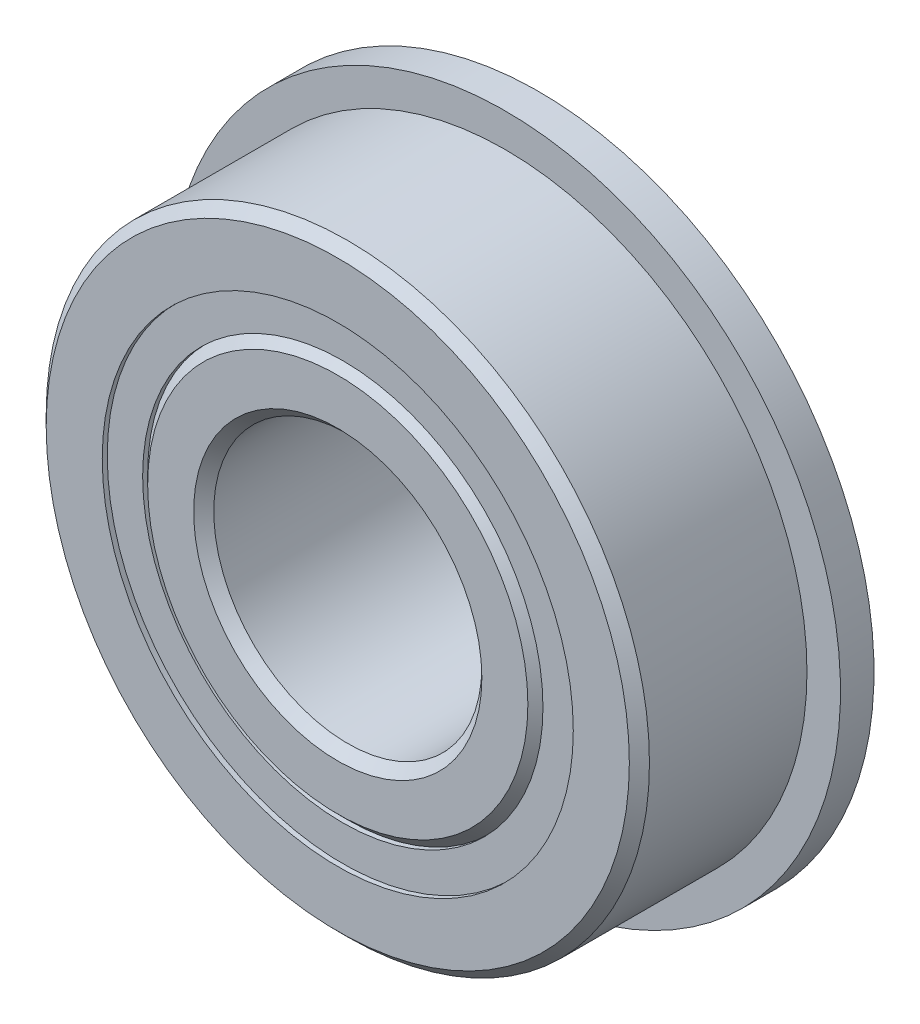
ISO-10303-21;
HEADER;
FILE_DESCRIPTION(('STEP AP214'),'2;1');
FILE_NAME('part.step','',(''),(''),'','','');
FILE_SCHEMA(('AUTOMOTIVE_DESIGN { 1 0 10303 214 1 1 1 1 }'));
ENDSEC;
DATA;
#1=APPLICATION_CONTEXT('core data for automotive mechanical design processes');
#2=APPLICATION_PROTOCOL_DEFINITION('international standard','automotive_design',2000,#1);
#3=PRODUCT_CONTEXT('',#1,'mechanical');
#4=PRODUCT('Part','Part','',(#3));
#5=PRODUCT_RELATED_PRODUCT_CATEGORY('part','',(#4));
#6=PRODUCT_DEFINITION_FORMATION('','',#4);
#7=PRODUCT_DEFINITION_CONTEXT('part definition',#1,'design');
#8=PRODUCT_DEFINITION('design','',#6,#7);
#9=PRODUCT_DEFINITION_SHAPE('','',#8);
#10=(LENGTH_UNIT() NAMED_UNIT(*) SI_UNIT(.MILLI.,.METRE.));
#11=(NAMED_UNIT(*) PLANE_ANGLE_UNIT() SI_UNIT($,.RADIAN.));
#12=(NAMED_UNIT(*) SI_UNIT($,.STERADIAN.) SOLID_ANGLE_UNIT());
#13=UNCERTAINTY_MEASURE_WITH_UNIT(LENGTH_MEASURE(1.E-05),#10,'distance_accuracy_value','');
#14=(GEOMETRIC_REPRESENTATION_CONTEXT(3) GLOBAL_UNCERTAINTY_ASSIGNED_CONTEXT((#13)) GLOBAL_UNIT_ASSIGNED_CONTEXT((#10,
#11,#12)) REPRESENTATION_CONTEXT('',''));
#15=CARTESIAN_POINT('',(0.,0.,0.));
#16=DIRECTION('',(0.,0.,1.));
#17=DIRECTION('',(1.,0.,0.));
#18=AXIS2_PLACEMENT_3D('',#15,#16,#17);
#19=CARTESIAN_POINT('',(0.,11.1561126373626,-4.524375));
#20=DIRECTION('',(0.,0.,1.));
#21=DIRECTION('',(1.,0.,0.));
#22=AXIS2_PLACEMENT_3D('',#19,#20,#21);
#23=PLANE('',#22);
#24=CARTESIAN_POINT('',(0.,0.,-4.524375));
#25=DIRECTION('',(0.,0.,1.));
#26=DIRECTION('',(1.,0.,0.));
#27=AXIS2_PLACEMENT_3D('',#24,#25,#26);
#28=CIRCLE('',#27,11.1561126373626);
#29=CARTESIAN_POINT('',(11.1561126373626,0.,-4.524375));
#30=VERTEX_POINT('',#29);
#31=EDGE_CURVE('E54',#30,#30,#28,.T.);
#32=ORIENTED_EDGE('',*,*,#31,.F.);
#33=EDGE_LOOP('',(#32));
#34=FACE_BOUND('',#33,.T.);
#35=CARTESIAN_POINT('',(0.,0.,-4.524375));
#36=DIRECTION('',(0.,0.,1.));
#37=DIRECTION('',(1.,0.,0.));
#38=AXIS2_PLACEMENT_3D('',#35,#36,#37);
#39=CIRCLE('',#38,9.48138736263736);
#40=CARTESIAN_POINT('',(9.48138736263736,0.,-4.524375));
#41=VERTEX_POINT('',#40);
#42=EDGE_CURVE('E11',#41,#41,#39,.T.);
#43=ORIENTED_EDGE('',*,*,#42,.T.);
#44=EDGE_LOOP('',(#43));
#45=FACE_BOUND('',#44,.T.);
#46=ADVANCED_FACE('F40',(#34,#45),#23,.F.);
#47=CARTESIAN_POINT('',(0.,0.,4.7625));
#48=DIRECTION('',(0.,0.,1.));
#49=DIRECTION('',(1.,0.,0.));
#50=AXIS2_PLACEMENT_3D('',#47,#48,#49);
#51=CYLINDRICAL_SURFACE('',#50,9.48138736263736);
#52=ORIENTED_EDGE('',*,*,#42,.F.);
#53=EDGE_LOOP('',(#52));
#54=FACE_BOUND('',#53,.T.);
#55=CARTESIAN_POINT('',(0.,0.,-2.27628073054021));
#56=DIRECTION('',(0.,0.,1.));
#57=DIRECTION('',(1.,0.,0.));
#58=AXIS2_PLACEMENT_3D('',#55,#56,#57);
#59=CIRCLE('',#58,9.48138736263736);
#60=CARTESIAN_POINT('',(9.48138736263736,0.,-2.27628073054021));
#61=VERTEX_POINT('',#60);
#62=EDGE_CURVE('E46',#61,#61,#59,.T.);
#63=ORIENTED_EDGE('',*,*,#62,.T.);
#64=EDGE_LOOP('',(#63));
#65=FACE_BOUND('',#64,.T.);
#66=ADVANCED_FACE('F63',(#54,#65),#51,.F.);
#67=CARTESIAN_POINT('',(0.,11.1561126373626,-2.27628073054021));
#68=DIRECTION('',(0.,0.,-1.));
#69=DIRECTION('',(-1.,0.,0.));
#70=AXIS2_PLACEMENT_3D('',#67,#68,#69);
#71=PLANE('',#70);
#72=ORIENTED_EDGE('',*,*,#62,.F.);
#73=EDGE_LOOP('',(#72));
#74=FACE_BOUND('',#73,.T.);
#75=CARTESIAN_POINT('',(0.,0.,-2.27628073054021));
#76=DIRECTION('',(0.,0.,1.));
#77=DIRECTION('',(1.,0.,0.));
#78=AXIS2_PLACEMENT_3D('',#75,#76,#77);
#79=CIRCLE('',#78,11.1561126373626);
#80=CARTESIAN_POINT('',(11.1561126373626,0.,-2.27628073054021));
#81=VERTEX_POINT('',#80);
#82=EDGE_CURVE('E50',#81,#81,#79,.T.);
#83=ORIENTED_EDGE('',*,*,#82,.T.);
#84=EDGE_LOOP('',(#83));
#85=FACE_BOUND('',#84,.T.);
#86=ADVANCED_FACE('F67',(#74,#85),#71,.F.);
#87=CARTESIAN_POINT('',(0.,0.,4.7625));
#88=DIRECTION('',(0.,0.,1.));
#89=DIRECTION('',(1.,0.,0.));
#90=AXIS2_PLACEMENT_3D('',#87,#88,#89);
#91=CYLINDRICAL_SURFACE('',#90,11.1561126373626);
#92=ORIENTED_EDGE('',*,*,#82,.F.);
#93=EDGE_LOOP('',(#92));
#94=FACE_BOUND('',#93,.T.);
#95=ORIENTED_EDGE('',*,*,#31,.T.);
#96=EDGE_LOOP('',(#95));
#97=FACE_BOUND('',#96,.T.);
#98=ADVANCED_FACE('F60',(#94,#97),#91,.T.);
#99=CLOSED_SHELL('',(#46,#66,#86,#98));
#100=MANIFOLD_SOLID_BREP('B2',#99);
#101=CARTESIAN_POINT('',(0.,11.1561126373626,4.524375));
#102=DIRECTION('',(0.,0.,-1.));
#103=DIRECTION('',(-1.,0.,0.));
#104=AXIS2_PLACEMENT_3D('',#101,#102,#103);
#105=PLANE('',#104);
#106=CARTESIAN_POINT('',(0.,0.,4.524375));
#107=DIRECTION('',(0.,0.,1.));
#108=DIRECTION('',(1.,0.,0.));
#109=AXIS2_PLACEMENT_3D('',#106,#107,#108);
#110=CIRCLE('',#109,9.48138736263736);
#111=CARTESIAN_POINT('',(9.48138736263736,0.,4.524375));
#112=VERTEX_POINT('',#111);
#113=EDGE_CURVE('E39',#112,#112,#110,.T.);
#114=ORIENTED_EDGE('',*,*,#113,.F.);
#115=EDGE_LOOP('',(#114));
#116=FACE_BOUND('',#115,.T.);
#117=CARTESIAN_POINT('',(0.,0.,4.524375));
#118=DIRECTION('',(0.,0.,1.));
#119=DIRECTION('',(1.,0.,0.));
#120=AXIS2_PLACEMENT_3D('',#117,#118,#119);
#121=CIRCLE('',#120,11.1561126373626);
#122=CARTESIAN_POINT('',(11.1561126373626,0.,4.524375));
#123=VERTEX_POINT('',#122);
#124=EDGE_CURVE('E122',#123,#123,#121,.T.);
#125=ORIENTED_EDGE('',*,*,#124,.T.);
#126=EDGE_LOOP('',(#125));
#127=FACE_BOUND('',#126,.T.);
#128=ADVANCED_FACE('F108',(#116,#127),#105,.F.);
#129=CARTESIAN_POINT('',(0.,0.,4.7625));
#130=DIRECTION('',(0.,0.,1.));
#131=DIRECTION('',(1.,0.,0.));
#132=AXIS2_PLACEMENT_3D('',#129,#130,#131);
#133=CYLINDRICAL_SURFACE('',#132,9.48138736263736);
#134=CARTESIAN_POINT('',(0.,0.,2.27628073054021));
#135=DIRECTION('',(0.,0.,1.));
#136=DIRECTION('',(1.,0.,0.));
#137=AXIS2_PLACEMENT_3D('',#134,#135,#136);
#138=CIRCLE('',#137,9.48138736263736);
#139=CARTESIAN_POINT('',(9.48138736263736,0.,2.27628073054021));
#140=VERTEX_POINT('',#139);
#141=EDGE_CURVE('E114',#140,#140,#138,.T.);
#142=ORIENTED_EDGE('',*,*,#141,.F.);
#143=EDGE_LOOP('',(#142));
#144=FACE_BOUND('',#143,.T.);
#145=ORIENTED_EDGE('',*,*,#113,.T.);
#146=EDGE_LOOP('',(#145));
#147=FACE_BOUND('',#146,.T.);
#148=ADVANCED_FACE('F137',(#144,#147),#133,.F.);
#149=CARTESIAN_POINT('',(0.,11.1561126373626,2.27628073054021));
#150=DIRECTION('',(0.,0.,1.));
#151=DIRECTION('',(1.,0.,0.));
#152=AXIS2_PLACEMENT_3D('',#149,#150,#151);
#153=PLANE('',#152);
#154=CARTESIAN_POINT('',(0.,0.,2.27628073054021));
#155=DIRECTION('',(0.,0.,1.));
#156=DIRECTION('',(1.,0.,0.));
#157=AXIS2_PLACEMENT_3D('',#154,#155,#156);
#158=CIRCLE('',#157,11.1561126373626);
#159=CARTESIAN_POINT('',(11.1561126373626,0.,2.27628073054021));
#160=VERTEX_POINT('',#159);
#161=EDGE_CURVE('E118',#160,#160,#158,.T.);
#162=ORIENTED_EDGE('',*,*,#161,.F.);
#163=EDGE_LOOP('',(#162));
#164=FACE_BOUND('',#163,.T.);
#165=ORIENTED_EDGE('',*,*,#141,.T.);
#166=EDGE_LOOP('',(#165));
#167=FACE_BOUND('',#166,.T.);
#168=ADVANCED_FACE('F132',(#164,#167),#153,.F.);
#169=CARTESIAN_POINT('',(0.,0.,4.7625));
#170=DIRECTION('',(0.,0.,1.));
#171=DIRECTION('',(1.,0.,0.));
#172=AXIS2_PLACEMENT_3D('',#169,#170,#171);
#173=CYLINDRICAL_SURFACE('',#172,11.1561126373626);
#174=ORIENTED_EDGE('',*,*,#124,.F.);
#175=EDGE_LOOP('',(#174));
#176=FACE_BOUND('',#175,.T.);
#177=ORIENTED_EDGE('',*,*,#161,.T.);
#178=EDGE_LOOP('',(#177));
#179=FACE_BOUND('',#178,.T.);
#180=ADVANCED_FACE('F129',(#176,#179),#173,.T.);
#181=CLOSED_SHELL('',(#128,#148,#168,#180));
#182=MANIFOLD_SOLID_BREP('B6',#181);
#183=CARTESIAN_POINT('',(-5.15937499999989,8.93629963530074,0.));
#184=DIRECTION('',(0.,0.,1.));
#185=DIRECTION('',(-0.499999999999989,0.866025403784445,0.));
#186=AXIS2_PLACEMENT_3D('',#183,#184,#185);
#187=SPHERICAL_SURFACE('',#186,2.27628073054021);
#188=CARTESIAN_POINT('',(-5.15937499999989,8.93629963530074,2.27628073054021));
#189=VERTEX_POINT('',#188);
#190=VERTEX_LOOP('',#189);
#191=FACE_BOUND('',#190,.T.);
#192=ADVANCED_FACE('F176',(#191),#187,.T.);
#193=CLOSED_SHELL('',(#192));
#194=MANIFOLD_SOLID_BREP('B34',#193);
#195=CARTESIAN_POINT('',(-8.93629963530062,5.1593750000001,0.));
#196=DIRECTION('',(0.,0.,1.));
#197=DIRECTION('',(-0.866025403784433,0.50000000000001,0.));
#198=AXIS2_PLACEMENT_3D('',#195,#196,#197);
#199=SPHERICAL_SURFACE('',#198,2.27628073054021);
#200=CARTESIAN_POINT('',(-8.93629963530062,5.1593750000001,2.27628073054021));
#201=VERTEX_POINT('',#200);
#202=VERTEX_LOOP('',#201);
#203=FACE_BOUND('',#202,.T.);
#204=ADVANCED_FACE('F197',(#203),#199,.T.);
#205=CLOSED_SHELL('',(#204));
#206=MANIFOLD_SOLID_BREP('B104',#205);
#207=CARTESIAN_POINT('',(-10.31875,1.08083169195563E-13,0.));
#208=DIRECTION('',(0.,0.,1.));
#209=DIRECTION('',(-1.,0.,0.));
#210=AXIS2_PLACEMENT_3D('',#207,#208,#209);
#211=SPHERICAL_SURFACE('',#210,2.27628073054021);
#212=CARTESIAN_POINT('',(-10.31875,1.08083169195563E-13,2.27628073054021));
#213=VERTEX_POINT('',#212);
#214=VERTEX_LOOP('',#213);
#215=FACE_BOUND('',#214,.T.);
#216=ADVANCED_FACE('F218',(#215),#211,.T.);
#217=CLOSED_SHELL('',(#216));
#218=MANIFOLD_SOLID_BREP('B172',#217);
#219=CARTESIAN_POINT('',(-8.93629963530072,-5.15937499999992,0.));
#220=DIRECTION('',(0.,0.,1.));
#221=DIRECTION('',(-0.866025403784443,-0.499999999999992,0.));
#222=AXIS2_PLACEMENT_3D('',#219,#220,#221);
#223=SPHERICAL_SURFACE('',#222,2.27628073054021);
#224=CARTESIAN_POINT('',(-8.93629963530072,-5.15937499999992,2.27628073054021));
#225=VERTEX_POINT('',#224);
#226=VERTEX_LOOP('',#225);
#227=FACE_BOUND('',#226,.T.);
#228=ADVANCED_FACE('F239',(#227),#223,.T.);
#229=CLOSED_SHELL('',(#228));
#230=MANIFOLD_SOLID_BREP('B193',#229);
#231=CARTESIAN_POINT('',(-5.15937500000007,-8.93629963530064,0.));
#232=DIRECTION('',(0.,0.,1.));
#233=DIRECTION('',(-0.500000000000007,-0.866025403784435,0.));
#234=AXIS2_PLACEMENT_3D('',#231,#232,#233);
#235=SPHERICAL_SURFACE('',#234,2.27628073054021);
#236=CARTESIAN_POINT('',(-5.15937500000007,-8.93629963530064,2.27628073054021));
#237=VERTEX_POINT('',#236);
#238=VERTEX_LOOP('',#237);
#239=FACE_BOUND('',#238,.T.);
#240=ADVANCED_FACE('F260',(#239),#235,.T.);
#241=CLOSED_SHELL('',(#240));
#242=MANIFOLD_SOLID_BREP('B214',#241);
#243=CARTESIAN_POINT('',(0.,-10.31875,0.));
#244=DIRECTION('',(0.,0.,1.));
#245=DIRECTION('',(0.,-1.,0.));
#246=AXIS2_PLACEMENT_3D('',#243,#244,#245);
#247=SPHERICAL_SURFACE('',#246,2.27628073054021);
#248=CARTESIAN_POINT('',(0.,-10.31875,2.27628073054021));
#249=VERTEX_POINT('',#248);
#250=VERTEX_LOOP('',#249);
#251=FACE_BOUND('',#250,.T.);
#252=ADVANCED_FACE('F281',(#251),#247,.T.);
#253=CLOSED_SHELL('',(#252));
#254=MANIFOLD_SOLID_BREP('B235',#253);
#255=CARTESIAN_POINT('',(5.15937499999995,-8.93629963530071,0.));
#256=DIRECTION('',(0.,0.,1.));
#257=DIRECTION('',(0.499999999999995,-0.866025403784442,0.));
#258=AXIS2_PLACEMENT_3D('',#255,#256,#257);
#259=SPHERICAL_SURFACE('',#258,2.27628073054021);
#260=CARTESIAN_POINT('',(5.15937499999995,-8.93629963530071,2.27628073054021));
#261=VERTEX_POINT('',#260);
#262=VERTEX_LOOP('',#261);
#263=FACE_BOUND('',#262,.T.);
#264=ADVANCED_FACE('F302',(#263),#259,.T.);
#265=CLOSED_SHELL('',(#264));
#266=MANIFOLD_SOLID_BREP('B256',#265);
#267=CARTESIAN_POINT('',(8.93629963530065,-5.15937500000004,0.));
#268=DIRECTION('',(0.,0.,1.));
#269=DIRECTION('',(0.866025403784436,-0.500000000000004,0.));
#270=AXIS2_PLACEMENT_3D('',#267,#268,#269);
#271=SPHERICAL_SURFACE('',#270,2.27628073054021);
#272=CARTESIAN_POINT('',(8.93629963530065,-5.15937500000004,2.27628073054021));
#273=VERTEX_POINT('',#272);
#274=VERTEX_LOOP('',#273);
#275=FACE_BOUND('',#274,.T.);
#276=ADVANCED_FACE('F323',(#275),#271,.T.);
#277=CLOSED_SHELL('',(#276));
#278=MANIFOLD_SOLID_BREP('B277',#277);
#279=CARTESIAN_POINT('',(10.31875,0.,0.));
#280=DIRECTION('',(0.,0.,1.));
#281=DIRECTION('',(1.,0.,0.));
#282=AXIS2_PLACEMENT_3D('',#279,#280,#281);
#283=SPHERICAL_SURFACE('',#282,2.27628073054021);
#284=CARTESIAN_POINT('',(10.31875,0.,2.27628073054021));
#285=VERTEX_POINT('',#284);
#286=VERTEX_LOOP('',#285);
#287=FACE_BOUND('',#286,.T.);
#288=ADVANCED_FACE('F344',(#287),#283,.T.);
#289=CLOSED_SHELL('',(#288));
#290=MANIFOLD_SOLID_BREP('B298',#289);
#291=CARTESIAN_POINT('',(8.93629963530069,5.15937499999998,0.));
#292=DIRECTION('',(0.,0.,1.));
#293=DIRECTION('',(0.86602540378444,0.499999999999998,0.));
#294=AXIS2_PLACEMENT_3D('',#291,#292,#293);
#295=SPHERICAL_SURFACE('',#294,2.27628073054021);
#296=CARTESIAN_POINT('',(8.93629963530069,5.15937499999998,2.27628073054021));
#297=VERTEX_POINT('',#296);
#298=VERTEX_LOOP('',#297);
#299=FACE_BOUND('',#298,.T.);
#300=ADVANCED_FACE('F365',(#299),#295,.T.);
#301=CLOSED_SHELL('',(#300));
#302=MANIFOLD_SOLID_BREP('B319',#301);
#303=CARTESIAN_POINT('',(5.15937500000001,8.93629963530067,0.));
#304=DIRECTION('',(0.,0.,1.));
#305=DIRECTION('',(0.500000000000001,0.866025403784438,0.));
#306=AXIS2_PLACEMENT_3D('',#303,#304,#305);
#307=SPHERICAL_SURFACE('',#306,2.27628073054021);
#308=CARTESIAN_POINT('',(5.15937500000001,8.93629963530067,2.27628073054021));
#309=VERTEX_POINT('',#308);
#310=VERTEX_LOOP('',#309);
#311=FACE_BOUND('',#310,.T.);
#312=ADVANCED_FACE('F386',(#311),#307,.T.);
#313=CLOSED_SHELL('',(#312));
#314=MANIFOLD_SOLID_BREP('B340',#313);
#315=CARTESIAN_POINT('',(0.,10.31875,0.));
#316=DIRECTION('',(0.,0.,1.));
#317=DIRECTION('',(0.,1.,0.));
#318=AXIS2_PLACEMENT_3D('',#315,#316,#317);
#319=SPHERICAL_SURFACE('',#318,2.27628073054021);
#320=CARTESIAN_POINT('',(0.,10.31875,2.27628073054021));
#321=VERTEX_POINT('',#320);
#322=VERTEX_LOOP('',#321);
#323=FACE_BOUND('',#322,.T.);
#324=ADVANCED_FACE('F409',(#323),#319,.T.);
#325=CLOSED_SHELL('',(#324));
#326=MANIFOLD_SOLID_BREP('B361',#325);
#327=CARTESIAN_POINT('',(0.,0.,4.28625));
#328=DIRECTION('',(0.,0.,-1.));
#329=DIRECTION('',(-1.,0.,0.));
#330=AXIS2_PLACEMENT_3D('',#327,#328,#329);
#331=CONICAL_SURFACE('',#330,9.48138736263736,0.785398163397449);
#332=CARTESIAN_POINT('',(0.,0.,4.7625));
#333=DIRECTION('',(0.,0.,1.));
#334=DIRECTION('',(1.,0.,0.));
#335=AXIS2_PLACEMENT_3D('',#332,#333,#334);
#336=CIRCLE('',#335,9.00513736263736);
#337=CARTESIAN_POINT('',(9.00513736263736,0.,4.7625));
#338=VERTEX_POINT('',#337);
#339=EDGE_CURVE('E463',#338,#338,#336,.T.);
#340=ORIENTED_EDGE('',*,*,#339,.F.);
#341=EDGE_LOOP('',(#340));
#342=FACE_BOUND('',#341,.T.);
#343=CARTESIAN_POINT('',(0.,0.,4.28625));
#344=DIRECTION('',(0.,0.,1.));
#345=DIRECTION('',(1.,0.,0.));
#346=AXIS2_PLACEMENT_3D('',#343,#344,#345);
#347=CIRCLE('',#346,9.48138736263736);
#348=CARTESIAN_POINT('',(9.48138736263736,0.,4.28625));
#349=VERTEX_POINT('',#348);
#350=EDGE_CURVE('E408',#349,#349,#347,.T.);
#351=ORIENTED_EDGE('',*,*,#350,.T.);
#352=EDGE_LOOP('',(#351));
#353=FACE_BOUND('',#352,.T.);
#354=ADVANCED_FACE('F429',(#342,#353),#331,.T.);
#355=CARTESIAN_POINT('',(0.,0.,4.7625));
#356=DIRECTION('',(0.,0.,1.));
#357=DIRECTION('',(1.,0.,0.));
#358=AXIS2_PLACEMENT_3D('',#355,#356,#357);
#359=CYLINDRICAL_SURFACE('',#358,9.48138736263736);
#360=ORIENTED_EDGE('',*,*,#350,.F.);
#361=EDGE_LOOP('',(#360));
#362=FACE_BOUND('',#361,.T.);
#363=CARTESIAN_POINT('',(0.,0.,2.11666666666666));
#364=DIRECTION('',(0.,0.,1.));
#365=DIRECTION('',(1.,0.,0.));
#366=AXIS2_PLACEMENT_3D('',#363,#364,#365);
#367=CIRCLE('',#366,9.48138736263736);
#368=CARTESIAN_POINT('',(9.48138736263736,0.,2.11666666666666));
#369=VERTEX_POINT('',#368);
#370=EDGE_CURVE('E435',#369,#369,#367,.T.);
#371=ORIENTED_EDGE('',*,*,#370,.T.);
#372=EDGE_LOOP('',(#371));
#373=FACE_BOUND('',#372,.T.);
#374=ADVANCED_FACE('F470',(#362,#373),#359,.T.);
#375=CARTESIAN_POINT('',(0.,0.,0.));
#376=DIRECTION('',(0.,0.,1.));
#377=DIRECTION('',(1.,0.,0.));
#378=AXIS2_PLACEMENT_3D('',#375,#376,#377);
#379=TOROIDAL_SURFACE('',#378,10.31875,2.27628073054021);
#380=ORIENTED_EDGE('',*,*,#370,.F.);
#381=EDGE_LOOP('',(#380));
#382=FACE_BOUND('',#381,.T.);
#383=CARTESIAN_POINT('',(0.,0.,-2.11666666666667));
#384=DIRECTION('',(0.,0.,1.));
#385=DIRECTION('',(1.,0.,0.));
#386=AXIS2_PLACEMENT_3D('',#383,#384,#385);
#387=CIRCLE('',#386,9.48138736263736);
#388=CARTESIAN_POINT('',(9.48138736263736,0.,-2.11666666666667));
#389=VERTEX_POINT('',#388);
#390=EDGE_CURVE('E439',#389,#389,#387,.T.);
#391=ORIENTED_EDGE('',*,*,#390,.T.);
#392=EDGE_LOOP('',(#391));
#393=FACE_BOUND('',#392,.T.);
#394=ADVANCED_FACE('F474',(#382,#393),#379,.F.);
#395=CARTESIAN_POINT('',(0.,0.,4.7625));
#396=DIRECTION('',(0.,0.,1.));
#397=DIRECTION('',(1.,0.,0.));
#398=AXIS2_PLACEMENT_3D('',#395,#396,#397);
#399=CYLINDRICAL_SURFACE('',#398,9.48138736263736);
#400=ORIENTED_EDGE('',*,*,#390,.F.);
#401=EDGE_LOOP('',(#400));
#402=FACE_BOUND('',#401,.T.);
#403=CARTESIAN_POINT('',(0.,0.,-5.87375));
#404=DIRECTION('',(0.,0.,1.));
#405=DIRECTION('',(1.,0.,0.));
#406=AXIS2_PLACEMENT_3D('',#403,#404,#405);
#407=CIRCLE('',#406,9.48138736263736);
#408=CARTESIAN_POINT('',(9.48138736263736,0.,-5.87375));
#409=VERTEX_POINT('',#408);
#410=EDGE_CURVE('E443',#409,#409,#407,.T.);
#411=ORIENTED_EDGE('',*,*,#410,.T.);
#412=EDGE_LOOP('',(#411));
#413=FACE_BOUND('',#412,.T.);
#414=ADVANCED_FACE('F479',(#402,#413),#399,.T.);
#415=CARTESIAN_POINT('',(0.,0.,-6.35));
#416=DIRECTION('',(0.,0.,1.));
#417=DIRECTION('',(1.,0.,0.));
#418=AXIS2_PLACEMENT_3D('',#415,#416,#417);
#419=CONICAL_SURFACE('',#418,9.00513736263736,0.78539816339745);
#420=ORIENTED_EDGE('',*,*,#410,.F.);
#421=EDGE_LOOP('',(#420));
#422=FACE_BOUND('',#421,.T.);
#423=CARTESIAN_POINT('',(0.,0.,-6.35));
#424=DIRECTION('',(0.,0.,1.));
#425=DIRECTION('',(1.,0.,0.));
#426=AXIS2_PLACEMENT_3D('',#423,#424,#425);
#427=CIRCLE('',#426,9.00513736263736);
#428=CARTESIAN_POINT('',(9.00513736263736,0.,-6.35));
#429=VERTEX_POINT('',#428);
#430=EDGE_CURVE('E448',#429,#429,#427,.T.);
#431=ORIENTED_EDGE('',*,*,#430,.T.);
#432=EDGE_LOOP('',(#431));
#433=FACE_BOUND('',#432,.T.);
#434=ADVANCED_FACE('F485',(#422,#433),#419,.T.);
#435=CARTESIAN_POINT('',(0.,9.00513736263736,-6.35));
#436=DIRECTION('',(0.,0.,1.));
#437=DIRECTION('',(1.,0.,0.));
#438=AXIS2_PLACEMENT_3D('',#435,#436,#437);
#439=PLANE('',#438);
#440=ORIENTED_EDGE('',*,*,#430,.F.);
#441=EDGE_LOOP('',(#440));
#442=FACE_BOUND('',#441,.T.);
#443=CARTESIAN_POINT('',(0.,0.,-6.35));
#444=DIRECTION('',(0.,0.,1.));
#445=DIRECTION('',(1.,0.,0.));
#446=AXIS2_PLACEMENT_3D('',#443,#444,#445);
#447=CIRCLE('',#446,6.82625);
#448=CARTESIAN_POINT('',(6.82625,0.,-6.35));
#449=VERTEX_POINT('',#448);
#450=EDGE_CURVE('E451',#449,#449,#447,.T.);
#451=ORIENTED_EDGE('',*,*,#450,.T.);
#452=EDGE_LOOP('',(#451));
#453=FACE_BOUND('',#452,.T.);
#454=ADVANCED_FACE('F489',(#442,#453),#439,.F.);
#455=CARTESIAN_POINT('',(0.,0.,-5.87374999999999));
#456=DIRECTION('',(0.,0.,-1.));
#457=DIRECTION('',(-1.,0.,0.));
#458=AXIS2_PLACEMENT_3D('',#455,#456,#457);
#459=CONICAL_SURFACE('',#458,6.35,0.785398163397447);
#460=ORIENTED_EDGE('',*,*,#450,.F.);
#461=EDGE_LOOP('',(#460));
#462=FACE_BOUND('',#461,.T.);
#463=CARTESIAN_POINT('',(0.,0.,-5.87374999999999));
#464=DIRECTION('',(0.,0.,1.));
#465=DIRECTION('',(1.,0.,0.));
#466=AXIS2_PLACEMENT_3D('',#463,#464,#465);
#467=CIRCLE('',#466,6.35);
#468=CARTESIAN_POINT('',(6.35,0.,-5.87374999999999));
#469=VERTEX_POINT('',#468);
#470=EDGE_CURVE('E454',#469,#469,#467,.T.);
#471=ORIENTED_EDGE('',*,*,#470,.T.);
#472=EDGE_LOOP('',(#471));
#473=FACE_BOUND('',#472,.T.);
#474=ADVANCED_FACE('F493',(#462,#473),#459,.F.);
#475=CARTESIAN_POINT('',(0.,0.,4.7625));
#476=DIRECTION('',(0.,0.,1.));
#477=DIRECTION('',(1.,0.,0.));
#478=AXIS2_PLACEMENT_3D('',#475,#476,#477);
#479=CYLINDRICAL_SURFACE('',#478,6.35);
#480=ORIENTED_EDGE('',*,*,#470,.F.);
#481=EDGE_LOOP('',(#480));
#482=FACE_BOUND('',#481,.T.);
#483=CARTESIAN_POINT('',(0.,0.,4.28625));
#484=DIRECTION('',(0.,0.,1.));
#485=DIRECTION('',(1.,0.,0.));
#486=AXIS2_PLACEMENT_3D('',#483,#484,#485);
#487=CIRCLE('',#486,6.35);
#488=CARTESIAN_POINT('',(6.35,0.,4.28625));
#489=VERTEX_POINT('',#488);
#490=EDGE_CURVE('E457',#489,#489,#487,.T.);
#491=ORIENTED_EDGE('',*,*,#490,.T.);
#492=EDGE_LOOP('',(#491));
#493=FACE_BOUND('',#492,.T.);
#494=ADVANCED_FACE('F497',(#482,#493),#479,.F.);
#495=CARTESIAN_POINT('',(0.,0.,4.7625));
#496=DIRECTION('',(0.,0.,1.));
#497=DIRECTION('',(1.,0.,0.));
#498=AXIS2_PLACEMENT_3D('',#495,#496,#497);
#499=CONICAL_SURFACE('',#498,6.82625,0.785398163397449);
#500=ORIENTED_EDGE('',*,*,#490,.F.);
#501=EDGE_LOOP('',(#500));
#502=FACE_BOUND('',#501,.T.);
#503=CARTESIAN_POINT('',(0.,0.,4.7625));
#504=DIRECTION('',(0.,0.,1.));
#505=DIRECTION('',(1.,0.,0.));
#506=AXIS2_PLACEMENT_3D('',#503,#504,#505);
#507=CIRCLE('',#506,6.82625);
#508=CARTESIAN_POINT('',(6.82625,0.,4.7625));
#509=VERTEX_POINT('',#508);
#510=EDGE_CURVE('E460',#509,#509,#507,.T.);
#511=ORIENTED_EDGE('',*,*,#510,.T.);
#512=EDGE_LOOP('',(#511));
#513=FACE_BOUND('',#512,.T.);
#514=ADVANCED_FACE('F501',(#502,#513),#499,.F.);
#515=CARTESIAN_POINT('',(0.,6.82625,4.7625));
#516=DIRECTION('',(0.,0.,-1.));
#517=DIRECTION('',(-1.,0.,0.));
#518=AXIS2_PLACEMENT_3D('',#515,#516,#517);
#519=PLANE('',#518);
#520=ORIENTED_EDGE('',*,*,#510,.F.);
#521=EDGE_LOOP('',(#520));
#522=FACE_BOUND('',#521,.T.);
#523=ORIENTED_EDGE('',*,*,#339,.T.);
#524=EDGE_LOOP('',(#523));
#525=FACE_BOUND('',#524,.T.);
#526=ADVANCED_FACE('F467',(#522,#525),#519,.F.);
#527=CLOSED_SHELL('',(#354,#374,#394,#414,#434,#454,#474,#494,#514,#526));
#528=MANIFOLD_SOLID_BREP('B382',#527);
#529=CARTESIAN_POINT('',(0.,0.,4.28625));
#530=DIRECTION('',(0.,0.,-1.));
#531=DIRECTION('',(-1.,0.,0.));
#532=AXIS2_PLACEMENT_3D('',#529,#530,#531);
#533=CONICAL_SURFACE('',#532,14.2875,0.785398163397449);
#534=CARTESIAN_POINT('',(0.,0.,4.7625));
#535=DIRECTION('',(0.,0.,1.));
#536=DIRECTION('',(1.,0.,0.));
#537=AXIS2_PLACEMENT_3D('',#534,#535,#536);
#538=CIRCLE('',#537,13.81125);
#539=CARTESIAN_POINT('',(13.81125,0.,4.7625));
#540=VERTEX_POINT('',#539);
#541=EDGE_CURVE('E603',#540,#540,#538,.T.);
#542=ORIENTED_EDGE('',*,*,#541,.F.);
#543=EDGE_LOOP('',(#542));
#544=FACE_BOUND('',#543,.T.);
#545=CARTESIAN_POINT('',(0.,0.,4.28625));
#546=DIRECTION('',(0.,0.,1.));
#547=DIRECTION('',(1.,0.,0.));
#548=AXIS2_PLACEMENT_3D('',#545,#546,#547);
#549=CIRCLE('',#548,14.2875);
#550=CARTESIAN_POINT('',(14.2875,0.,4.28625));
#551=VERTEX_POINT('',#550);
#552=EDGE_CURVE('E428',#551,#551,#549,.T.);
#553=ORIENTED_EDGE('',*,*,#552,.T.);
#554=EDGE_LOOP('',(#553));
#555=FACE_BOUND('',#554,.T.);
#556=ADVANCED_FACE('F581',(#544,#555),#533,.T.);
#557=CARTESIAN_POINT('',(0.,0.,4.7625));
#558=DIRECTION('',(0.,0.,1.));
#559=DIRECTION('',(1.,0.,0.));
#560=AXIS2_PLACEMENT_3D('',#557,#558,#559);
#561=CYLINDRICAL_SURFACE('',#560,14.2875);
#562=CARTESIAN_POINT('',(0.,0.,-3.175));
#563=DIRECTION('',(0.,0.,1.));
#564=DIRECTION('',(1.,0.,0.));
#565=AXIS2_PLACEMENT_3D('',#562,#563,#564);
#566=CIRCLE('',#565,14.2875);
#567=CARTESIAN_POINT('',(14.2875,0.,-3.175));
#568=VERTEX_POINT('',#567);
#569=EDGE_CURVE('E606',#568,#568,#566,.T.);
#570=ORIENTED_EDGE('',*,*,#569,.T.);
#571=EDGE_LOOP('',(#570));
#572=FACE_BOUND('',#571,.T.);
#573=ORIENTED_EDGE('',*,*,#552,.F.);
#574=EDGE_LOOP('',(#573));
#575=FACE_BOUND('',#574,.T.);
#576=ADVANCED_FACE('F626',(#572,#575),#561,.T.);
#577=CARTESIAN_POINT('',(0.,13.81125,-4.7625));
#578=DIRECTION('',(0.,0.,1.));
#579=DIRECTION('',(1.,0.,0.));
#580=AXIS2_PLACEMENT_3D('',#577,#578,#579);
#581=PLANE('',#580);
#582=CARTESIAN_POINT('',(0.,0.,-4.7625));
#583=DIRECTION('',(0.,0.,1.));
#584=DIRECTION('',(1.,0.,0.));
#585=AXIS2_PLACEMENT_3D('',#582,#583,#584);
#586=CIRCLE('',#585,11.1561126373626);
#587=CARTESIAN_POINT('',(11.1561126373626,0.,-4.7625));
#588=VERTEX_POINT('',#587);
#589=EDGE_CURVE('E587',#588,#588,#586,.T.);
#590=ORIENTED_EDGE('',*,*,#589,.T.);
#591=EDGE_LOOP('',(#590));
#592=FACE_BOUND('',#591,.T.);
#593=CARTESIAN_POINT('',(0.,0.,-4.7625));
#594=DIRECTION('',(0.,0.,-1.));
#595=DIRECTION('',(-1.,0.,0.));
#596=AXIS2_PLACEMENT_3D('',#593,#594,#595);
#597=CIRCLE('',#596,15.875);
#598=CARTESIAN_POINT('',(-15.875,0.,-4.7625));
#599=VERTEX_POINT('',#598);
#600=EDGE_CURVE('E609',#599,#599,#597,.T.);
#601=ORIENTED_EDGE('',*,*,#600,.T.);
#602=EDGE_LOOP('',(#601));
#603=FACE_BOUND('',#602,.T.);
#604=ADVANCED_FACE('F629',(#592,#603),#581,.F.);
#605=CARTESIAN_POINT('',(0.,0.,4.7625));
#606=DIRECTION('',(0.,0.,1.));
#607=DIRECTION('',(1.,0.,0.));
#608=AXIS2_PLACEMENT_3D('',#605,#606,#607);
#609=CYLINDRICAL_SURFACE('',#608,11.1561126373626);
#610=CARTESIAN_POINT('',(0.,0.,-2.11666666666667));
#611=DIRECTION('',(0.,0.,1.));
#612=DIRECTION('',(1.,0.,0.));
#613=AXIS2_PLACEMENT_3D('',#610,#611,#612);
#614=CIRCLE('',#613,11.1561126373626);
#615=CARTESIAN_POINT('',(11.1561126373626,0.,-2.11666666666667));
#616=VERTEX_POINT('',#615);
#617=EDGE_CURVE('E591',#616,#616,#614,.T.);
#618=ORIENTED_EDGE('',*,*,#617,.T.);
#619=EDGE_LOOP('',(#618));
#620=FACE_BOUND('',#619,.T.);
#621=ORIENTED_EDGE('',*,*,#589,.F.);
#622=EDGE_LOOP('',(#621));
#623=FACE_BOUND('',#622,.T.);
#624=ADVANCED_FACE('F634',(#620,#623),#609,.F.);
#625=CARTESIAN_POINT('',(0.,0.,0.));
#626=DIRECTION('',(0.,0.,1.));
#627=DIRECTION('',(1.,0.,0.));
#628=AXIS2_PLACEMENT_3D('',#625,#626,#627);
#629=TOROIDAL_SURFACE('',#628,10.31875,2.27628073054021);
#630=ORIENTED_EDGE('',*,*,#617,.F.);
#631=EDGE_LOOP('',(#630));
#632=FACE_BOUND('',#631,.T.);
#633=CARTESIAN_POINT('',(0.,0.,2.11666666666667));
#634=DIRECTION('',(0.,0.,1.));
#635=DIRECTION('',(1.,0.,0.));
#636=AXIS2_PLACEMENT_3D('',#633,#634,#635);
#637=CIRCLE('',#636,11.1561126373626);
#638=CARTESIAN_POINT('',(11.1561126373626,0.,2.11666666666667));
#639=VERTEX_POINT('',#638);
#640=EDGE_CURVE('E595',#639,#639,#637,.T.);
#641=ORIENTED_EDGE('',*,*,#640,.T.);
#642=EDGE_LOOP('',(#641));
#643=FACE_BOUND('',#642,.T.);
#644=ADVANCED_FACE('F640',(#632,#643),#629,.F.);
#645=CARTESIAN_POINT('',(0.,0.,4.7625));
#646=DIRECTION('',(0.,0.,1.));
#647=DIRECTION('',(1.,0.,0.));
#648=AXIS2_PLACEMENT_3D('',#645,#646,#647);
#649=CYLINDRICAL_SURFACE('',#648,11.1561126373626);
#650=ORIENTED_EDGE('',*,*,#640,.F.);
#651=EDGE_LOOP('',(#650));
#652=FACE_BOUND('',#651,.T.);
#653=CARTESIAN_POINT('',(0.,0.,4.7625));
#654=DIRECTION('',(0.,0.,1.));
#655=DIRECTION('',(1.,0.,0.));
#656=AXIS2_PLACEMENT_3D('',#653,#654,#655);
#657=CIRCLE('',#656,11.1561126373626);
#658=CARTESIAN_POINT('',(11.1561126373626,0.,4.7625));
#659=VERTEX_POINT('',#658);
#660=EDGE_CURVE('E600',#659,#659,#657,.T.);
#661=ORIENTED_EDGE('',*,*,#660,.T.);
#662=EDGE_LOOP('',(#661));
#663=FACE_BOUND('',#662,.T.);
#664=ADVANCED_FACE('F644',(#652,#663),#649,.F.);
#665=CARTESIAN_POINT('',(0.,13.81125,4.7625));
#666=DIRECTION('',(0.,0.,-1.));
#667=DIRECTION('',(-1.,0.,0.));
#668=AXIS2_PLACEMENT_3D('',#665,#666,#667);
#669=PLANE('',#668);
#670=ORIENTED_EDGE('',*,*,#660,.F.);
#671=EDGE_LOOP('',(#670));
#672=FACE_BOUND('',#671,.T.);
#673=ORIENTED_EDGE('',*,*,#541,.T.);
#674=EDGE_LOOP('',(#673));
#675=FACE_BOUND('',#674,.T.);
#676=ADVANCED_FACE('F622',(#672,#675),#669,.F.);
#677=CARTESIAN_POINT('',(0.,11.1561126373626,-3.175));
#678=DIRECTION('',(0.,0.,1.));
#679=DIRECTION('',(1.,0.,0.));
#680=AXIS2_PLACEMENT_3D('',#677,#678,#679);
#681=PLANE('',#680);
#682=CARTESIAN_POINT('',(0.,0.,-3.175));
#683=DIRECTION('',(0.,0.,-1.));
#684=DIRECTION('',(-1.,0.,0.));
#685=AXIS2_PLACEMENT_3D('',#682,#683,#684);
#686=CIRCLE('',#685,15.875);
#687=CARTESIAN_POINT('',(-15.875,0.,-3.175));
#688=VERTEX_POINT('',#687);
#689=EDGE_CURVE('E612',#688,#688,#686,.T.);
#690=ORIENTED_EDGE('',*,*,#689,.F.);
#691=EDGE_LOOP('',(#690));
#692=FACE_BOUND('',#691,.T.);
#693=ORIENTED_EDGE('',*,*,#569,.F.);
#694=EDGE_LOOP('',(#693));
#695=FACE_BOUND('',#694,.T.);
#696=ADVANCED_FACE('F619',(#692,#695),#681,.T.);
#697=CARTESIAN_POINT('',(0.,0.,-4.7625));
#698=DIRECTION('',(0.,0.,-1.));
#699=DIRECTION('',(-1.,0.,0.));
#700=AXIS2_PLACEMENT_3D('',#697,#698,#699);
#701=CYLINDRICAL_SURFACE('',#700,15.875);
#702=ORIENTED_EDGE('',*,*,#689,.T.);
#703=EDGE_LOOP('',(#702));
#704=FACE_BOUND('',#703,.T.);
#705=ORIENTED_EDGE('',*,*,#600,.F.);
#706=EDGE_LOOP('',(#705));
#707=FACE_BOUND('',#706,.T.);
#708=ADVANCED_FACE('F616',(#704,#707),#701,.T.);
#709=CLOSED_SHELL('',(#556,#576,#604,#624,#644,#664,#676,#696,#708));
#710=MANIFOLD_SOLID_BREP('B403',#709);
#711=ADVANCED_BREP_SHAPE_REPRESENTATION('',(#18,#100,#182,#194,#206,#218,#230,#242,#254,#266,
#278,#290,#302,#314,#326,#528,#710),#14);
#712=SHAPE_DEFINITION_REPRESENTATION(#9,#711);
ENDSEC;
END-ISO-10303-21;
